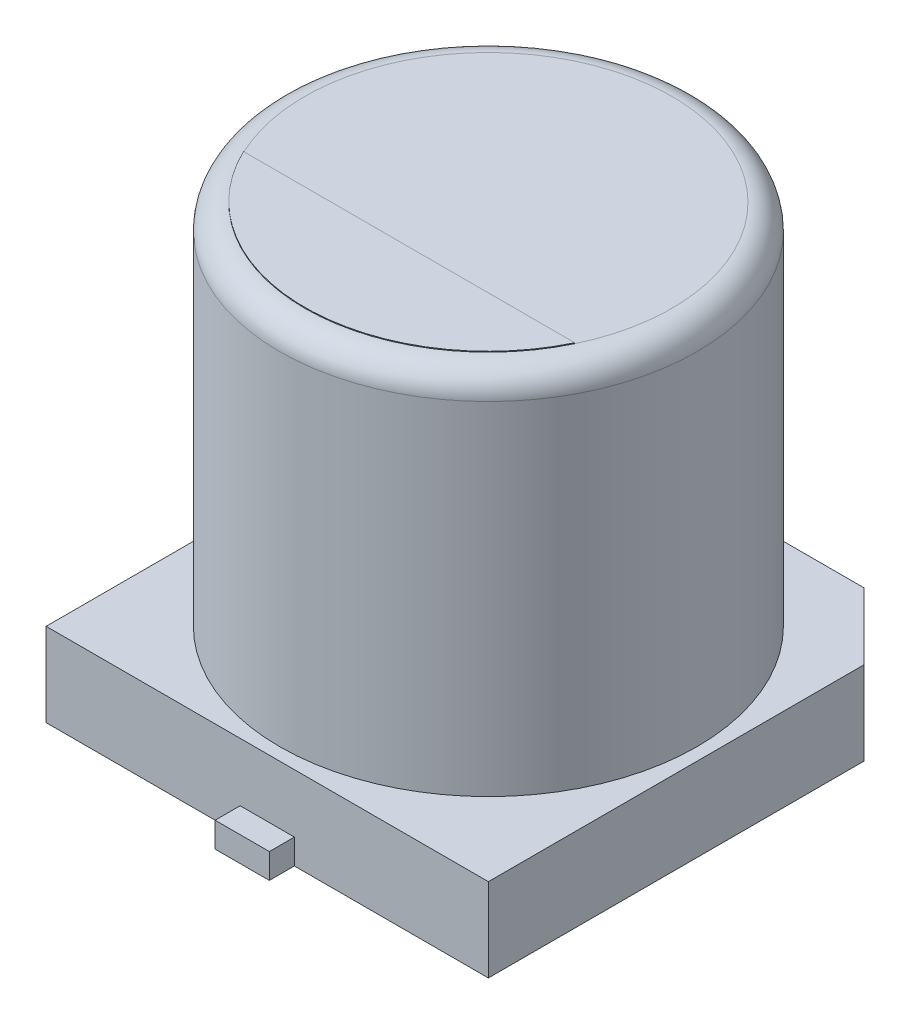
ISO-10303-21;
HEADER;
FILE_DESCRIPTION(('STEP AP214'),'2;1');
FILE_NAME('part.step','',(''),(''),'','','');
FILE_SCHEMA(('AUTOMOTIVE_DESIGN { 1 0 10303 214 1 1 1 1 }'));
ENDSEC;
DATA;
#1=APPLICATION_CONTEXT('core data for automotive mechanical design processes');
#2=APPLICATION_PROTOCOL_DEFINITION('international standard','automotive_design',2000,#1);
#3=PRODUCT_CONTEXT('',#1,'mechanical');
#4=PRODUCT('Part','Part','',(#3));
#5=PRODUCT_RELATED_PRODUCT_CATEGORY('part','',(#4));
#6=PRODUCT_DEFINITION_FORMATION('','',#4);
#7=PRODUCT_DEFINITION_CONTEXT('part definition',#1,'design');
#8=PRODUCT_DEFINITION('design','',#6,#7);
#9=PRODUCT_DEFINITION_SHAPE('','',#8);
#10=(LENGTH_UNIT() NAMED_UNIT(*) SI_UNIT(.MILLI.,.METRE.));
#11=(NAMED_UNIT(*) PLANE_ANGLE_UNIT() SI_UNIT($,.RADIAN.));
#12=(NAMED_UNIT(*) SI_UNIT($,.STERADIAN.) SOLID_ANGLE_UNIT());
#13=UNCERTAINTY_MEASURE_WITH_UNIT(LENGTH_MEASURE(1.E-05),#10,'distance_accuracy_value','');
#14=(GEOMETRIC_REPRESENTATION_CONTEXT(3) GLOBAL_UNCERTAINTY_ASSIGNED_CONTEXT((#13)) GLOBAL_UNIT_ASSIGNED_CONTEXT((#10,
#11,#12)) REPRESENTATION_CONTEXT('',''));
#15=CARTESIAN_POINT('',(0.,0.,0.));
#16=DIRECTION('',(0.,0.,1.));
#17=DIRECTION('',(1.,0.,0.));
#18=AXIS2_PLACEMENT_3D('',#15,#16,#17);
#19=CARTESIAN_POINT('',(0.,5.4,0.));
#20=DIRECTION('',(0.,1.,0.));
#21=DIRECTION('',(0.,0.,1.));
#22=AXIS2_PLACEMENT_3D('',#19,#20,#21);
#23=PLANE('',#22);
#24=CARTESIAN_POINT('',(0.,5.4,0.));
#25=DIRECTION('',(0.,1.,0.));
#26=DIRECTION('',(0.,0.,1.));
#27=AXIS2_PLACEMENT_3D('',#24,#25,#26);
#28=CIRCLE('',#27,2.2);
#29=CARTESIAN_POINT('',(1.98448253331796,5.4,0.949646815903639));
#30=VERTEX_POINT('',#29);
#31=CARTESIAN_POINT('',(-1.98448253331796,5.4,0.949646815903639));
#32=VERTEX_POINT('',#31);
#33=EDGE_CURVE('E221',#30,#32,#28,.T.);
#34=ORIENTED_EDGE('',*,*,#33,.T.);
#35=DIRECTION('',(-1.,0.,0.));
#36=VECTOR('',#35,1.);
#37=CARTESIAN_POINT('',(-1.98448253331796,5.4,0.949646815903639));
#38=LINE('',#37,#36);
#39=EDGE_CURVE('E159',#30,#32,#38,.T.);
#40=ORIENTED_EDGE('',*,*,#39,.F.);
#41=EDGE_LOOP('',(#34,#40));
#42=FACE_BOUND('',#41,.T.);
#43=ADVANCED_FACE('F33',(#42),#23,.T.);
#44=CARTESIAN_POINT('',(-1.85,1.,-2.65));
#45=DIRECTION('',(0.,0.,1.));
#46=DIRECTION('',(1.,0.,0.));
#47=AXIS2_PLACEMENT_3D('',#44,#45,#46);
#48=PLANE('',#47);
#49=DIRECTION('',(0.,-1.,0.));
#50=VECTOR('',#49,1.);
#51=CARTESIAN_POINT('',(0.324999999999999,1.,-2.65));
#52=LINE('',#51,#50);
#53=CARTESIAN_POINT('',(0.324999999999999,0.3,-2.65));
#54=VERTEX_POINT('',#53);
#55=CARTESIAN_POINT('',(0.325,0.,-2.65));
#56=VERTEX_POINT('',#55);
#57=EDGE_CURVE('E188',#54,#56,#52,.T.);
#58=ORIENTED_EDGE('',*,*,#57,.F.);
#59=DIRECTION('',(-1.,0.,0.));
#60=VECTOR('',#59,1.);
#61=CARTESIAN_POINT('',(-1.85,0.3,-2.65));
#62=LINE('',#61,#60);
#63=CARTESIAN_POINT('',(-0.325,0.3,-2.65));
#64=VERTEX_POINT('',#63);
#65=EDGE_CURVE('E11',#54,#64,#62,.T.);
#66=ORIENTED_EDGE('',*,*,#65,.T.);
#67=DIRECTION('',(0.,1.,0.));
#68=VECTOR('',#67,1.);
#69=CARTESIAN_POINT('',(-0.325,1.,-2.65));
#70=LINE('',#69,#68);
#71=CARTESIAN_POINT('',(-0.325,0.,-2.65));
#72=VERTEX_POINT('',#71);
#73=EDGE_CURVE('E186',#72,#64,#70,.T.);
#74=ORIENTED_EDGE('',*,*,#73,.F.);
#75=DIRECTION('',(-1.,0.,0.));
#76=VECTOR('',#75,1.);
#77=CARTESIAN_POINT('',(-1.85,0.,-2.65));
#78=LINE('',#77,#76);
#79=CARTESIAN_POINT('',(-1.85,0.,-2.65));
#80=VERTEX_POINT('',#79);
#81=EDGE_CURVE('E242',#72,#80,#78,.T.);
#82=ORIENTED_EDGE('',*,*,#81,.T.);
#83=DIRECTION('',(0.,-1.,0.));
#84=VECTOR('',#83,1.);
#85=CARTESIAN_POINT('',(-1.85,1.,-2.65));
#86=LINE('',#85,#84);
#87=CARTESIAN_POINT('',(-1.85,1.,-2.65));
#88=VERTEX_POINT('',#87);
#89=EDGE_CURVE('E259',#88,#80,#86,.T.);
#90=ORIENTED_EDGE('',*,*,#89,.F.);
#91=DIRECTION('',(-1.,0.,0.));
#92=VECTOR('',#91,1.);
#93=CARTESIAN_POINT('',(-1.85,1.,-2.65));
#94=LINE('',#93,#92);
#95=CARTESIAN_POINT('',(1.85,1.,-2.65));
#96=VERTEX_POINT('',#95);
#97=EDGE_CURVE('E229',#96,#88,#94,.T.);
#98=ORIENTED_EDGE('',*,*,#97,.F.);
#99=DIRECTION('',(0.,-1.,0.));
#100=VECTOR('',#99,1.);
#101=CARTESIAN_POINT('',(1.85,1.,-2.65));
#102=LINE('',#101,#100);
#103=CARTESIAN_POINT('',(1.85,0.,-2.65));
#104=VERTEX_POINT('',#103);
#105=EDGE_CURVE('E262',#96,#104,#102,.T.);
#106=ORIENTED_EDGE('',*,*,#105,.T.);
#107=EDGE_CURVE('E243',#104,#56,#78,.T.);
#108=ORIENTED_EDGE('',*,*,#107,.T.);
#109=EDGE_LOOP('',(#58,#66,#74,#82,#90,#98,#106,#108));
#110=FACE_BOUND('',#109,.T.);
#111=ADVANCED_FACE('F319',(#110),#48,.F.);
#112=CARTESIAN_POINT('',(2.65,1.,2.65));
#113=DIRECTION('',(0.,0.,-1.));
#114=DIRECTION('',(-1.,0.,0.));
#115=AXIS2_PLACEMENT_3D('',#112,#113,#114);
#116=PLANE('',#115);
#117=DIRECTION('',(0.,-1.,0.));
#118=VECTOR('',#117,1.);
#119=CARTESIAN_POINT('',(-0.325,1.,2.65));
#120=LINE('',#119,#118);
#121=CARTESIAN_POINT('',(-0.325,0.3,2.65));
#122=VERTEX_POINT('',#121);
#123=CARTESIAN_POINT('',(-0.325,0.,2.65));
#124=VERTEX_POINT('',#123);
#125=EDGE_CURVE('E214',#122,#124,#120,.T.);
#126=ORIENTED_EDGE('',*,*,#125,.F.);
#127=DIRECTION('',(-1.,0.,0.));
#128=VECTOR('',#127,1.);
#129=CARTESIAN_POINT('',(2.65,0.3,2.65));
#130=LINE('',#129,#128);
#131=CARTESIAN_POINT('',(0.324999999999999,0.3,2.65));
#132=VERTEX_POINT('',#131);
#133=EDGE_CURVE('E41',#132,#122,#130,.T.);
#134=ORIENTED_EDGE('',*,*,#133,.F.);
#135=DIRECTION('',(0.,1.,0.));
#136=VECTOR('',#135,1.);
#137=CARTESIAN_POINT('',(0.324999999999999,1.,2.65));
#138=LINE('',#137,#136);
#139=CARTESIAN_POINT('',(0.325,0.,2.65));
#140=VERTEX_POINT('',#139);
#141=EDGE_CURVE('E211',#140,#132,#138,.T.);
#142=ORIENTED_EDGE('',*,*,#141,.F.);
#143=DIRECTION('',(1.,0.,0.));
#144=VECTOR('',#143,1.);
#145=CARTESIAN_POINT('',(2.65,0.,2.65));
#146=LINE('',#145,#144);
#147=CARTESIAN_POINT('',(2.65,0.,2.65));
#148=VERTEX_POINT('',#147);
#149=EDGE_CURVE('E249',#140,#148,#146,.T.);
#150=ORIENTED_EDGE('',*,*,#149,.T.);
#151=DIRECTION('',(0.,-1.,0.));
#152=VECTOR('',#151,1.);
#153=CARTESIAN_POINT('',(2.65,1.,2.65));
#154=LINE('',#153,#152);
#155=CARTESIAN_POINT('',(2.65,1.,2.65));
#156=VERTEX_POINT('',#155);
#157=EDGE_CURVE('E237',#156,#148,#154,.T.);
#158=ORIENTED_EDGE('',*,*,#157,.F.);
#159=DIRECTION('',(1.,0.,0.));
#160=VECTOR('',#159,1.);
#161=CARTESIAN_POINT('',(2.65,1.,2.65));
#162=LINE('',#161,#160);
#163=CARTESIAN_POINT('',(-2.65,1.,2.65));
#164=VERTEX_POINT('',#163);
#165=EDGE_CURVE('E235',#164,#156,#162,.T.);
#166=ORIENTED_EDGE('',*,*,#165,.F.);
#167=DIRECTION('',(0.,-1.,0.));
#168=VECTOR('',#167,1.);
#169=CARTESIAN_POINT('',(-2.65,1.,2.65));
#170=LINE('',#169,#168);
#171=CARTESIAN_POINT('',(-2.65,0.,2.65));
#172=VERTEX_POINT('',#171);
#173=EDGE_CURVE('E253',#164,#172,#170,.T.);
#174=ORIENTED_EDGE('',*,*,#173,.T.);
#175=EDGE_CURVE('E227',#172,#124,#146,.T.);
#176=ORIENTED_EDGE('',*,*,#175,.T.);
#177=EDGE_LOOP('',(#126,#134,#142,#150,#158,#166,#174,#176));
#178=FACE_BOUND('',#177,.T.);
#179=ADVANCED_FACE('F289',(#178),#116,.F.);
#180=CARTESIAN_POINT('',(2.65,1.,-1.85));
#181=DIRECTION('',(-1.,0.,0.));
#182=DIRECTION('',(0.,0.,1.));
#183=AXIS2_PLACEMENT_3D('',#180,#181,#182);
#184=PLANE('',#183);
#185=DIRECTION('',(0.,0.,-1.));
#186=VECTOR('',#185,1.);
#187=CARTESIAN_POINT('',(2.65,0.,-1.85));
#188=LINE('',#187,#186);
#189=CARTESIAN_POINT('',(2.65,0.,-1.85));
#190=VERTEX_POINT('',#189);
#191=EDGE_CURVE('E217',#148,#190,#188,.T.);
#192=ORIENTED_EDGE('',*,*,#191,.T.);
#193=DIRECTION('',(0.,-1.,0.));
#194=VECTOR('',#193,1.);
#195=CARTESIAN_POINT('',(2.65,1.,-1.85));
#196=LINE('',#195,#194);
#197=CARTESIAN_POINT('',(2.65,1.,-1.85));
#198=VERTEX_POINT('',#197);
#199=EDGE_CURVE('E222',#198,#190,#196,.T.);
#200=ORIENTED_EDGE('',*,*,#199,.F.);
#201=DIRECTION('',(0.,0.,-1.));
#202=VECTOR('',#201,1.);
#203=CARTESIAN_POINT('',(2.65,1.,-1.85));
#204=LINE('',#203,#202);
#205=EDGE_CURVE('E223',#156,#198,#204,.T.);
#206=ORIENTED_EDGE('',*,*,#205,.F.);
#207=ORIENTED_EDGE('',*,*,#157,.T.);
#208=EDGE_LOOP('',(#192,#200,#206,#207));
#209=FACE_BOUND('',#208,.T.);
#210=ADVANCED_FACE('F296',(#209),#184,.F.);
#211=CARTESIAN_POINT('',(1.85,1.,-2.65));
#212=DIRECTION('',(-0.707106781186548,0.,0.707106781186547));
#213=DIRECTION('',(0.707106781186547,0.,0.707106781186548));
#214=AXIS2_PLACEMENT_3D('',#211,#212,#213);
#215=PLANE('',#214);
#216=DIRECTION('',(-0.707106781186547,0.,-0.707106781186548));
#217=VECTOR('',#216,1.);
#218=CARTESIAN_POINT('',(1.85,0.,-2.65));
#219=LINE('',#218,#217);
#220=EDGE_CURVE('E240',#190,#104,#219,.T.);
#221=ORIENTED_EDGE('',*,*,#220,.T.);
#222=ORIENTED_EDGE('',*,*,#105,.F.);
#223=DIRECTION('',(-0.707106781186547,0.,-0.707106781186548));
#224=VECTOR('',#223,1.);
#225=CARTESIAN_POINT('',(1.85,1.,-2.65));
#226=LINE('',#225,#224);
#227=EDGE_CURVE('E226',#198,#96,#226,.T.);
#228=ORIENTED_EDGE('',*,*,#227,.F.);
#229=ORIENTED_EDGE('',*,*,#199,.T.);
#230=EDGE_LOOP('',(#221,#222,#228,#229));
#231=FACE_BOUND('',#230,.T.);
#232=ADVANCED_FACE('F303',(#231),#215,.F.);
#233=CARTESIAN_POINT('',(-2.65,1.,-1.85));
#234=DIRECTION('',(0.707106781186547,0.,0.707106781186547));
#235=DIRECTION('',(0.707106781186548,0.,-0.707106781186548));
#236=AXIS2_PLACEMENT_3D('',#233,#234,#235);
#237=PLANE('',#236);
#238=DIRECTION('',(-0.707106781186547,0.,0.707106781186547));
#239=VECTOR('',#238,1.);
#240=CARTESIAN_POINT('',(-2.65,0.,-1.85));
#241=LINE('',#240,#239);
#242=CARTESIAN_POINT('',(-2.65,0.,-1.85));
#243=VERTEX_POINT('',#242);
#244=EDGE_CURVE('E245',#80,#243,#241,.T.);
#245=ORIENTED_EDGE('',*,*,#244,.T.);
#246=DIRECTION('',(0.,-1.,0.));
#247=VECTOR('',#246,1.);
#248=CARTESIAN_POINT('',(-2.65,1.,-1.85));
#249=LINE('',#248,#247);
#250=CARTESIAN_POINT('',(-2.65,1.,-1.85));
#251=VERTEX_POINT('',#250);
#252=EDGE_CURVE('E256',#251,#243,#249,.T.);
#253=ORIENTED_EDGE('',*,*,#252,.F.);
#254=DIRECTION('',(-0.707106781186547,0.,0.707106781186547));
#255=VECTOR('',#254,1.);
#256=CARTESIAN_POINT('',(-2.65,1.,-1.85));
#257=LINE('',#256,#255);
#258=EDGE_CURVE('E231',#88,#251,#257,.T.);
#259=ORIENTED_EDGE('',*,*,#258,.F.);
#260=ORIENTED_EDGE('',*,*,#89,.T.);
#261=EDGE_LOOP('',(#245,#253,#259,#260));
#262=FACE_BOUND('',#261,.T.);
#263=ADVANCED_FACE('F317',(#262),#237,.F.);
#264=CARTESIAN_POINT('',(-2.65,1.,2.65));
#265=DIRECTION('',(1.,0.,0.));
#266=DIRECTION('',(0.,0.,-1.));
#267=AXIS2_PLACEMENT_3D('',#264,#265,#266);
#268=PLANE('',#267);
#269=DIRECTION('',(0.,0.,1.));
#270=VECTOR('',#269,1.);
#271=CARTESIAN_POINT('',(-2.65,0.,2.65));
#272=LINE('',#271,#270);
#273=EDGE_CURVE('E247',#243,#172,#272,.T.);
#274=ORIENTED_EDGE('',*,*,#273,.T.);
#275=ORIENTED_EDGE('',*,*,#173,.F.);
#276=DIRECTION('',(0.,0.,1.));
#277=VECTOR('',#276,1.);
#278=CARTESIAN_POINT('',(-2.65,1.,2.65));
#279=LINE('',#278,#277);
#280=EDGE_CURVE('E233',#251,#164,#279,.T.);
#281=ORIENTED_EDGE('',*,*,#280,.F.);
#282=ORIENTED_EDGE('',*,*,#252,.T.);
#283=EDGE_LOOP('',(#274,#275,#281,#282));
#284=FACE_BOUND('',#283,.T.);
#285=ADVANCED_FACE('F313',(#284),#268,.F.);
#286=CARTESIAN_POINT('',(0.,1.,0.));
#287=DIRECTION('',(0.,-1.,0.));
#288=DIRECTION('',(0.,0.,-1.));
#289=AXIS2_PLACEMENT_3D('',#286,#287,#288);
#290=PLANE('',#289);
#291=CARTESIAN_POINT('',(0.,1.,0.));
#292=DIRECTION('',(0.,-1.,0.));
#293=DIRECTION('',(0.,0.,-1.));
#294=AXIS2_PLACEMENT_3D('',#291,#292,#293);
#295=CIRCLE('',#294,2.5);
#296=CARTESIAN_POINT('',(0.,1.,-2.5));
#297=VERTEX_POINT('',#296);
#298=EDGE_CURVE('E218',#297,#297,#295,.F.);
#299=ORIENTED_EDGE('',*,*,#298,.F.);
#300=EDGE_LOOP('',(#299));
#301=FACE_BOUND('',#300,.T.);
#302=ORIENTED_EDGE('',*,*,#205,.T.);
#303=ORIENTED_EDGE('',*,*,#227,.T.);
#304=ORIENTED_EDGE('',*,*,#97,.T.);
#305=ORIENTED_EDGE('',*,*,#258,.T.);
#306=ORIENTED_EDGE('',*,*,#280,.T.);
#307=ORIENTED_EDGE('',*,*,#165,.T.);
#308=EDGE_LOOP('',(#302,#303,#304,#305,#306,#307));
#309=FACE_BOUND('',#308,.T.);
#310=ADVANCED_FACE('F306',(#301,#309),#290,.F.);
#311=CARTESIAN_POINT('',(0.,0.,0.));
#312=DIRECTION('',(0.,-1.,0.));
#313=DIRECTION('',(0.,0.,-1.));
#314=AXIS2_PLACEMENT_3D('',#311,#312,#313);
#315=PLANE('',#314);
#316=ORIENTED_EDGE('',*,*,#81,.F.);
#317=DIRECTION('',(0.,0.,1.));
#318=VECTOR('',#317,1.);
#319=CARTESIAN_POINT('',(-0.325,0.,-0.75));
#320=LINE('',#319,#318);
#321=CARTESIAN_POINT('',(-0.325,0.,-2.95));
#322=VERTEX_POINT('',#321);
#323=EDGE_CURVE('E172',#322,#72,#320,.T.);
#324=ORIENTED_EDGE('',*,*,#323,.F.);
#325=DIRECTION('',(-1.,0.,0.));
#326=VECTOR('',#325,1.);
#327=CARTESIAN_POINT('',(0.325,0.,-2.95));
#328=LINE('',#327,#326);
#329=CARTESIAN_POINT('',(0.325,0.,-2.95));
#330=VERTEX_POINT('',#329);
#331=EDGE_CURVE('E164',#330,#322,#328,.T.);
#332=ORIENTED_EDGE('',*,*,#331,.F.);
#333=DIRECTION('',(0.,0.,-1.));
#334=VECTOR('',#333,1.);
#335=CARTESIAN_POINT('',(0.325,0.,-0.75));
#336=LINE('',#335,#334);
#337=EDGE_CURVE('E162',#56,#330,#336,.T.);
#338=ORIENTED_EDGE('',*,*,#337,.F.);
#339=ORIENTED_EDGE('',*,*,#107,.F.);
#340=ORIENTED_EDGE('',*,*,#220,.F.);
#341=ORIENTED_EDGE('',*,*,#191,.F.);
#342=ORIENTED_EDGE('',*,*,#149,.F.);
#343=DIRECTION('',(0.,0.,-1.));
#344=VECTOR('',#343,1.);
#345=CARTESIAN_POINT('',(0.325,0.,0.75));
#346=LINE('',#345,#344);
#347=CARTESIAN_POINT('',(0.325,0.,2.95));
#348=VERTEX_POINT('',#347);
#349=EDGE_CURVE('E195',#348,#140,#346,.T.);
#350=ORIENTED_EDGE('',*,*,#349,.F.);
#351=DIRECTION('',(1.,0.,0.));
#352=VECTOR('',#351,1.);
#353=CARTESIAN_POINT('',(0.325,0.,2.95));
#354=LINE('',#353,#352);
#355=CARTESIAN_POINT('',(-0.325,0.,2.95));
#356=VERTEX_POINT('',#355);
#357=EDGE_CURVE('E202',#356,#348,#354,.T.);
#358=ORIENTED_EDGE('',*,*,#357,.F.);
#359=DIRECTION('',(0.,0.,1.));
#360=VECTOR('',#359,1.);
#361=CARTESIAN_POINT('',(-0.325,0.,0.75));
#362=LINE('',#361,#360);
#363=EDGE_CURVE('E191',#124,#356,#362,.T.);
#364=ORIENTED_EDGE('',*,*,#363,.F.);
#365=ORIENTED_EDGE('',*,*,#175,.F.);
#366=ORIENTED_EDGE('',*,*,#273,.F.);
#367=ORIENTED_EDGE('',*,*,#244,.F.);
#368=EDGE_LOOP('',(#316,#324,#332,#338,#339,#340,#341,#342,#350,#358,#364,#365,#366,#367));
#369=FACE_BOUND('',#368,.T.);
#370=ADVANCED_FACE('F298',(#369),#315,.T.);
#371=CARTESIAN_POINT('',(0.,5.4,0.));
#372=DIRECTION('',(0.,-1.,0.));
#373=DIRECTION('',(0.,0.,-1.));
#374=AXIS2_PLACEMENT_3D('',#371,#372,#373);
#375=CYLINDRICAL_SURFACE('',#374,2.5);
#376=CARTESIAN_POINT('',(0.,5.1,0.));
#377=DIRECTION('',(0.,1.,0.));
#378=DIRECTION('',(0.,0.,1.));
#379=AXIS2_PLACEMENT_3D('',#376,#377,#378);
#380=CIRCLE('',#379,2.5);
#381=CARTESIAN_POINT('',(0.,5.1,2.5));
#382=VERTEX_POINT('',#381);
#383=EDGE_CURVE('E268',#382,#382,#380,.F.);
#384=ORIENTED_EDGE('',*,*,#383,.T.);
#385=EDGE_LOOP('',(#384));
#386=FACE_BOUND('',#385,.T.);
#387=ORIENTED_EDGE('',*,*,#298,.T.);
#388=EDGE_LOOP('',(#387));
#389=FACE_BOUND('',#388,.T.);
#390=ADVANCED_FACE('F354',(#386,#389),#375,.T.);
#391=CARTESIAN_POINT('',(0.,5.1,0.));
#392=DIRECTION('',(0.,1.,0.));
#393=DIRECTION('',(0.,0.,1.));
#394=AXIS2_PLACEMENT_3D('',#391,#392,#393);
#395=TOROIDAL_SURFACE('',#394,2.2,0.3);
#396=ORIENTED_EDGE('',*,*,#383,.F.);
#397=EDGE_LOOP('',(#396));
#398=FACE_BOUND('',#397,.T.);
#399=ORIENTED_EDGE('',*,*,#33,.F.);
#400=CARTESIAN_POINT('',(0.,5.4,0.));
#401=DIRECTION('',(0.,1.,0.));
#402=DIRECTION('',(0.,0.,1.));
#403=AXIS2_PLACEMENT_3D('',#400,#401,#402);
#404=CIRCLE('',#403,2.2);
#405=EDGE_CURVE('E47',#32,#30,#404,.T.);
#406=ORIENTED_EDGE('',*,*,#405,.F.);
#407=EDGE_LOOP('',(#399,#406));
#408=FACE_BOUND('',#407,.T.);
#409=ADVANCED_FACE('F35',(#398,#408),#395,.T.);
#410=CARTESIAN_POINT('',(0.,0.3,0.));
#411=DIRECTION('',(0.,-1.,0.));
#412=DIRECTION('',(0.,0.,-1.));
#413=AXIS2_PLACEMENT_3D('',#410,#411,#412);
#414=PLANE('',#413);
#415=DIRECTION('',(0.,0.,-1.));
#416=VECTOR('',#415,1.);
#417=CARTESIAN_POINT('',(0.325,0.3,0.75));
#418=LINE('',#417,#416);
#419=CARTESIAN_POINT('',(0.325,0.3,2.95));
#420=VERTEX_POINT('',#419);
#421=EDGE_CURVE('E197',#420,#132,#418,.T.);
#422=ORIENTED_EDGE('',*,*,#421,.T.);
#423=ORIENTED_EDGE('',*,*,#133,.T.);
#424=DIRECTION('',(0.,0.,1.));
#425=VECTOR('',#424,1.);
#426=CARTESIAN_POINT('',(-0.325,0.3,0.75));
#427=LINE('',#426,#425);
#428=CARTESIAN_POINT('',(-0.325,0.3,2.95));
#429=VERTEX_POINT('',#428);
#430=EDGE_CURVE('E192',#122,#429,#427,.T.);
#431=ORIENTED_EDGE('',*,*,#430,.T.);
#432=DIRECTION('',(1.,0.,0.));
#433=VECTOR('',#432,1.);
#434=CARTESIAN_POINT('',(0.325,0.3,2.95));
#435=LINE('',#434,#433);
#436=EDGE_CURVE('E194',#429,#420,#435,.T.);
#437=ORIENTED_EDGE('',*,*,#436,.T.);
#438=EDGE_LOOP('',(#422,#423,#431,#437));
#439=FACE_BOUND('',#438,.T.);
#440=ADVANCED_FACE('F273',(#439),#414,.F.);
#441=CARTESIAN_POINT('',(-0.325,0.3,0.75));
#442=DIRECTION('',(1.,0.,0.));
#443=DIRECTION('',(0.,0.,-1.));
#444=AXIS2_PLACEMENT_3D('',#441,#442,#443);
#445=PLANE('',#444);
#446=ORIENTED_EDGE('',*,*,#430,.F.);
#447=ORIENTED_EDGE('',*,*,#125,.T.);
#448=ORIENTED_EDGE('',*,*,#363,.T.);
#449=DIRECTION('',(0.,-1.,0.));
#450=VECTOR('',#449,1.);
#451=CARTESIAN_POINT('',(-0.325,0.3,2.95));
#452=LINE('',#451,#450);
#453=EDGE_CURVE('E208',#429,#356,#452,.T.);
#454=ORIENTED_EDGE('',*,*,#453,.F.);
#455=EDGE_LOOP('',(#446,#447,#448,#454));
#456=FACE_BOUND('',#455,.T.);
#457=ADVANCED_FACE('F280',(#456),#445,.F.);
#458=CARTESIAN_POINT('',(0.325,0.3,0.75));
#459=DIRECTION('',(-1.,0.,0.));
#460=DIRECTION('',(0.,0.,1.));
#461=AXIS2_PLACEMENT_3D('',#458,#459,#460);
#462=PLANE('',#461);
#463=ORIENTED_EDGE('',*,*,#349,.T.);
#464=ORIENTED_EDGE('',*,*,#141,.T.);
#465=ORIENTED_EDGE('',*,*,#421,.F.);
#466=DIRECTION('',(0.,-1.,0.));
#467=VECTOR('',#466,1.);
#468=CARTESIAN_POINT('',(0.325,0.3,2.95));
#469=LINE('',#468,#467);
#470=EDGE_CURVE('E200',#420,#348,#469,.T.);
#471=ORIENTED_EDGE('',*,*,#470,.T.);
#472=EDGE_LOOP('',(#463,#464,#465,#471));
#473=FACE_BOUND('',#472,.T.);
#474=ADVANCED_FACE('F288',(#473),#462,.F.);
#475=CARTESIAN_POINT('',(0.325,0.3,2.95));
#476=DIRECTION('',(0.,0.,-1.));
#477=DIRECTION('',(-1.,0.,0.));
#478=AXIS2_PLACEMENT_3D('',#475,#476,#477);
#479=PLANE('',#478);
#480=ORIENTED_EDGE('',*,*,#357,.T.);
#481=ORIENTED_EDGE('',*,*,#470,.F.);
#482=ORIENTED_EDGE('',*,*,#436,.F.);
#483=ORIENTED_EDGE('',*,*,#453,.T.);
#484=EDGE_LOOP('',(#480,#481,#482,#483));
#485=FACE_BOUND('',#484,.T.);
#486=ADVANCED_FACE('F284',(#485),#479,.F.);
#487=CARTESIAN_POINT('',(0.,0.3,0.));
#488=DIRECTION('',(0.,1.,0.));
#489=DIRECTION('',(0.,0.,1.));
#490=AXIS2_PLACEMENT_3D('',#487,#488,#489);
#491=PLANE('',#490);
#492=ORIENTED_EDGE('',*,*,#65,.F.);
#493=DIRECTION('',(0.,0.,-1.));
#494=VECTOR('',#493,1.);
#495=CARTESIAN_POINT('',(0.325,0.3,-0.75));
#496=LINE('',#495,#494);
#497=CARTESIAN_POINT('',(0.325,0.3,-2.95));
#498=VERTEX_POINT('',#497);
#499=EDGE_CURVE('E169',#54,#498,#496,.T.);
#500=ORIENTED_EDGE('',*,*,#499,.T.);
#501=DIRECTION('',(-1.,0.,0.));
#502=VECTOR('',#501,1.);
#503=CARTESIAN_POINT('',(0.325,0.3,-2.95));
#504=LINE('',#503,#502);
#505=CARTESIAN_POINT('',(-0.325,0.3,-2.95));
#506=VERTEX_POINT('',#505);
#507=EDGE_CURVE('E171',#498,#506,#504,.T.);
#508=ORIENTED_EDGE('',*,*,#507,.T.);
#509=DIRECTION('',(0.,0.,1.));
#510=VECTOR('',#509,1.);
#511=CARTESIAN_POINT('',(-0.325,0.3,-0.75));
#512=LINE('',#511,#510);
#513=EDGE_CURVE('E174',#506,#64,#512,.T.);
#514=ORIENTED_EDGE('',*,*,#513,.T.);
#515=EDGE_LOOP('',(#492,#500,#508,#514));
#516=FACE_BOUND('',#515,.T.);
#517=ADVANCED_FACE('F334',(#516),#491,.T.);
#518=CARTESIAN_POINT('',(0.325,0.3,-0.75));
#519=DIRECTION('',(-1.,0.,0.));
#520=DIRECTION('',(0.,0.,1.));
#521=AXIS2_PLACEMENT_3D('',#518,#519,#520);
#522=PLANE('',#521);
#523=ORIENTED_EDGE('',*,*,#499,.F.);
#524=ORIENTED_EDGE('',*,*,#57,.T.);
#525=ORIENTED_EDGE('',*,*,#337,.T.);
#526=DIRECTION('',(0.,-1.,0.));
#527=VECTOR('',#526,1.);
#528=CARTESIAN_POINT('',(0.325,0.3,-2.95));
#529=LINE('',#528,#527);
#530=EDGE_CURVE('E183',#498,#330,#529,.T.);
#531=ORIENTED_EDGE('',*,*,#530,.F.);
#532=EDGE_LOOP('',(#523,#524,#525,#531));
#533=FACE_BOUND('',#532,.T.);
#534=ADVANCED_FACE('F332',(#533),#522,.F.);
#535=CARTESIAN_POINT('',(-0.325,0.3,-0.75));
#536=DIRECTION('',(1.,0.,0.));
#537=DIRECTION('',(0.,0.,-1.));
#538=AXIS2_PLACEMENT_3D('',#535,#536,#537);
#539=PLANE('',#538);
#540=ORIENTED_EDGE('',*,*,#323,.T.);
#541=ORIENTED_EDGE('',*,*,#73,.T.);
#542=ORIENTED_EDGE('',*,*,#513,.F.);
#543=DIRECTION('',(0.,-1.,0.));
#544=VECTOR('',#543,1.);
#545=CARTESIAN_POINT('',(-0.325,0.3,-2.95));
#546=LINE('',#545,#544);
#547=EDGE_CURVE('E176',#506,#322,#546,.T.);
#548=ORIENTED_EDGE('',*,*,#547,.T.);
#549=EDGE_LOOP('',(#540,#541,#542,#548));
#550=FACE_BOUND('',#549,.T.);
#551=ADVANCED_FACE('F323',(#550),#539,.F.);
#552=CARTESIAN_POINT('',(0.325,0.3,-2.95));
#553=DIRECTION('',(0.,0.,1.));
#554=DIRECTION('',(1.,0.,0.));
#555=AXIS2_PLACEMENT_3D('',#552,#553,#554);
#556=PLANE('',#555);
#557=ORIENTED_EDGE('',*,*,#331,.T.);
#558=ORIENTED_EDGE('',*,*,#547,.F.);
#559=ORIENTED_EDGE('',*,*,#507,.F.);
#560=ORIENTED_EDGE('',*,*,#530,.T.);
#561=EDGE_LOOP('',(#557,#558,#559,#560));
#562=FACE_BOUND('',#561,.T.);
#563=ADVANCED_FACE('F328',(#562),#556,.F.);
#564=CARTESIAN_POINT('',(0.,5.41,0.));
#565=DIRECTION('',(0.,-1.,0.));
#566=DIRECTION('',(0.,0.,-1.));
#567=AXIS2_PLACEMENT_3D('',#564,#565,#566);
#568=CYLINDRICAL_SURFACE('',#567,2.2);
#569=ORIENTED_EDGE('',*,*,#405,.T.);
#570=DIRECTION('',(0.,-1.,0.));
#571=VECTOR('',#570,1.);
#572=CARTESIAN_POINT('',(1.98448253331796,5.41,0.949646815903639));
#573=LINE('',#572,#571);
#574=CARTESIAN_POINT('',(1.98448253331796,5.41,0.949646815903639));
#575=VERTEX_POINT('',#574);
#576=EDGE_CURVE('E150',#575,#30,#573,.T.);
#577=ORIENTED_EDGE('',*,*,#576,.F.);
#578=CARTESIAN_POINT('',(0.,5.41,0.));
#579=DIRECTION('',(0.,1.,0.));
#580=DIRECTION('',(0.,0.,1.));
#581=AXIS2_PLACEMENT_3D('',#578,#579,#580);
#582=CIRCLE('',#581,2.2);
#583=CARTESIAN_POINT('',(-1.98448253331796,5.41,0.949646815903639));
#584=VERTEX_POINT('',#583);
#585=EDGE_CURVE('E155',#584,#575,#582,.T.);
#586=ORIENTED_EDGE('',*,*,#585,.F.);
#587=DIRECTION('',(0.,-1.,0.));
#588=VECTOR('',#587,1.);
#589=CARTESIAN_POINT('',(-1.98448253331796,5.41,0.949646815903639));
#590=LINE('',#589,#588);
#591=EDGE_CURVE('E152',#584,#32,#590,.T.);
#592=ORIENTED_EDGE('',*,*,#591,.T.);
#593=EDGE_LOOP('',(#569,#577,#586,#592));
#594=FACE_BOUND('',#593,.T.);
#595=ADVANCED_FACE('F161',(#594),#568,.T.);
#596=CARTESIAN_POINT('',(-1.98448253331796,5.41,0.949646815903639));
#597=DIRECTION('',(0.,0.,1.));
#598=DIRECTION('',(1.,0.,0.));
#599=AXIS2_PLACEMENT_3D('',#596,#597,#598);
#600=PLANE('',#599);
#601=ORIENTED_EDGE('',*,*,#39,.T.);
#602=ORIENTED_EDGE('',*,*,#591,.F.);
#603=DIRECTION('',(-1.,0.,0.));
#604=VECTOR('',#603,1.);
#605=CARTESIAN_POINT('',(-1.98448253331796,5.41,0.949646815903639));
#606=LINE('',#605,#604);
#607=EDGE_CURVE('E145',#575,#584,#606,.T.);
#608=ORIENTED_EDGE('',*,*,#607,.F.);
#609=ORIENTED_EDGE('',*,*,#576,.T.);
#610=EDGE_LOOP('',(#601,#602,#608,#609));
#611=FACE_BOUND('',#610,.T.);
#612=ADVANCED_FACE('F148',(#611),#600,.F.);
#613=CARTESIAN_POINT('',(0.,5.41,0.));
#614=DIRECTION('',(0.,1.,0.));
#615=DIRECTION('',(0.,0.,1.));
#616=AXIS2_PLACEMENT_3D('',#613,#614,#615);
#617=PLANE('',#616);
#618=ORIENTED_EDGE('',*,*,#585,.T.);
#619=ORIENTED_EDGE('',*,*,#607,.T.);
#620=EDGE_LOOP('',(#618,#619));
#621=FACE_BOUND('',#620,.T.);
#622=ADVANCED_FACE('F157',(#621),#617,.T.);
#623=CLOSED_SHELL('',(#43,#111,#179,#210,#232,#263,#285,#310,#370,#390,#409,#440,#457,#474,#486,
#517,#534,#551,#563,#595,#612,#622));
#624=MANIFOLD_SOLID_BREP('B2',#623);
#625=ADVANCED_BREP_SHAPE_REPRESENTATION('',(#18,#624),#14);
#626=SHAPE_DEFINITION_REPRESENTATION(#9,#625);
ENDSEC;
END-ISO-10303-21;
